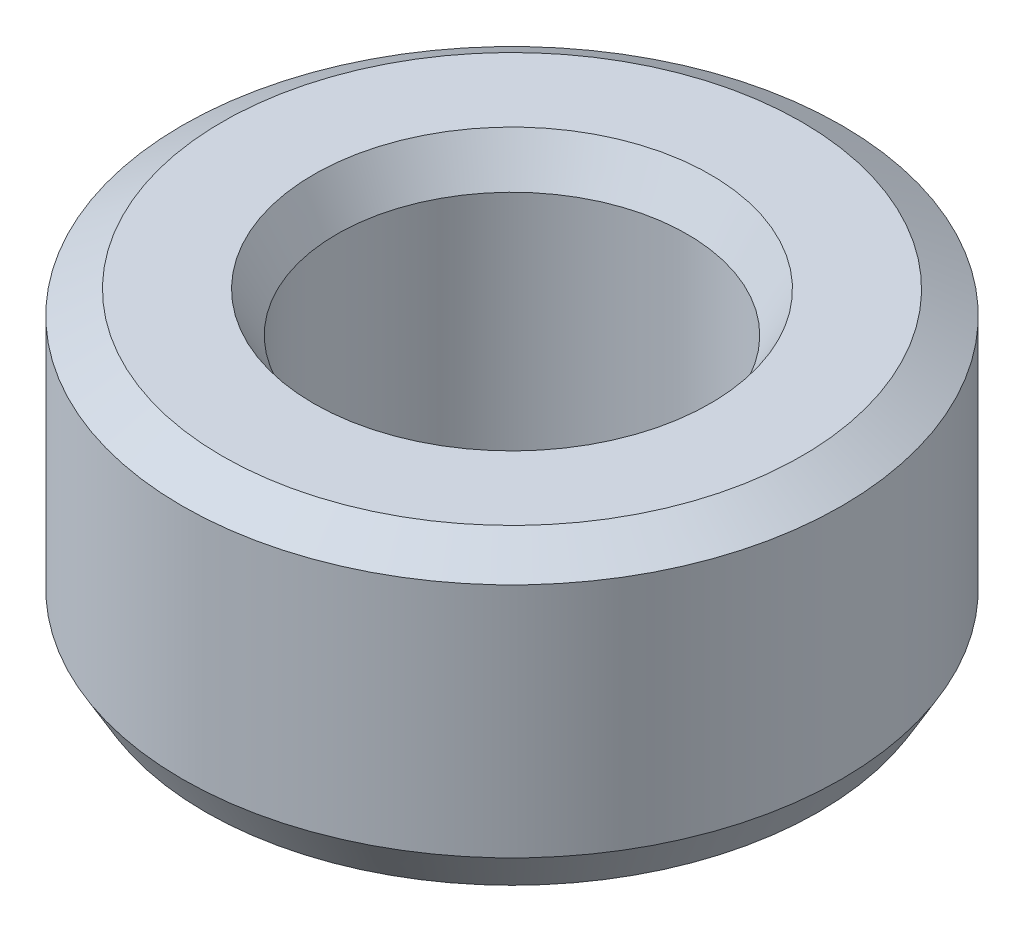
ISO-10303-21;
HEADER;
FILE_DESCRIPTION(('STEP AP214'),'2;1');
FILE_NAME('part.step','',(''),(''),'','','');
FILE_SCHEMA(('AUTOMOTIVE_DESIGN { 1 0 10303 214 1 1 1 1 }'));
ENDSEC;
DATA;
#1=APPLICATION_CONTEXT('core data for automotive mechanical design processes');
#2=APPLICATION_PROTOCOL_DEFINITION('international standard','automotive_design',2000,#1);
#3=PRODUCT_CONTEXT('',#1,'mechanical');
#4=PRODUCT('Part','Part','',(#3));
#5=PRODUCT_RELATED_PRODUCT_CATEGORY('part','',(#4));
#6=PRODUCT_DEFINITION_FORMATION('','',#4);
#7=PRODUCT_DEFINITION_CONTEXT('part definition',#1,'design');
#8=PRODUCT_DEFINITION('design','',#6,#7);
#9=PRODUCT_DEFINITION_SHAPE('','',#8);
#10=(LENGTH_UNIT() NAMED_UNIT(*) SI_UNIT(.MILLI.,.METRE.));
#11=(NAMED_UNIT(*) PLANE_ANGLE_UNIT() SI_UNIT($,.RADIAN.));
#12=(NAMED_UNIT(*) SI_UNIT($,.STERADIAN.) SOLID_ANGLE_UNIT());
#13=UNCERTAINTY_MEASURE_WITH_UNIT(LENGTH_MEASURE(1.E-05),#10,'distance_accuracy_value','');
#14=(GEOMETRIC_REPRESENTATION_CONTEXT(3) GLOBAL_UNCERTAINTY_ASSIGNED_CONTEXT((#13)) GLOBAL_UNIT_ASSIGNED_CONTEXT((#10,
#11,#12)) REPRESENTATION_CONTEXT('',''));
#15=CARTESIAN_POINT('',(0.,0.,0.));
#16=DIRECTION('',(0.,0.,1.));
#17=DIRECTION('',(1.,0.,0.));
#18=AXIS2_PLACEMENT_3D('',#15,#16,#17);
#19=CARTESIAN_POINT('',(0.,11.3614162811045,0.));
#20=DIRECTION('',(0.,-1.,0.));
#21=DIRECTION('',(0.,0.,-1.));
#22=AXIS2_PLACEMENT_3D('',#19,#20,#21);
#23=CYLINDRICAL_SURFACE('',#22,12.5);
#24=CARTESIAN_POINT('',(0.,1.51972632499675,0.));
#25=DIRECTION('',(0.,1.,0.));
#26=DIRECTION('',(0.,0.,1.));
#27=AXIS2_PLACEMENT_3D('',#24,#25,#26);
#28=CIRCLE('',#27,12.5);
#29=CARTESIAN_POINT('',(0.,1.51972632499675,12.5));
#30=VERTEX_POINT('',#29);
#31=EDGE_CURVE('E10',#30,#30,#28,.T.);
#32=ORIENTED_EDGE('',*,*,#31,.T.);
#33=EDGE_LOOP('',(#32));
#34=FACE_BOUND('',#33,.T.);
#35=CARTESIAN_POINT('',(0.,10.484001878273,0.));
#36=DIRECTION('',(0.,1.,0.));
#37=DIRECTION('',(0.,0.,1.));
#38=AXIS2_PLACEMENT_3D('',#35,#36,#37);
#39=CIRCLE('',#38,12.5);
#40=CARTESIAN_POINT('',(0.,10.484001878273,12.5));
#41=VERTEX_POINT('',#40);
#42=EDGE_CURVE('E50',#41,#41,#39,.F.);
#43=ORIENTED_EDGE('',*,*,#42,.T.);
#44=EDGE_LOOP('',(#43));
#45=FACE_BOUND('',#44,.T.);
#46=ADVANCED_FACE('F39',(#34,#45),#23,.T.);
#47=CARTESIAN_POINT('',(0.,11.3614162811045,0.));
#48=DIRECTION('',(0.,1.,0.));
#49=DIRECTION('',(0.,0.,1.));
#50=AXIS2_PLACEMENT_3D('',#47,#48,#49);
#51=PLANE('',#50);
#52=CARTESIAN_POINT('',(0.,11.3614162811045,0.));
#53=DIRECTION('',(0.,1.,0.));
#54=DIRECTION('',(0.,0.,1.));
#55=AXIS2_PLACEMENT_3D('',#52,#53,#54);
#56=CIRCLE('',#55,7.51986047261818);
#57=CARTESIAN_POINT('',(0.,11.3614162811045,7.51986047261818));
#58=VERTEX_POINT('',#57);
#59=EDGE_CURVE('E58',#58,#58,#56,.F.);
#60=ORIENTED_EDGE('',*,*,#59,.T.);
#61=EDGE_LOOP('',(#60));
#62=FACE_BOUND('',#61,.T.);
#63=CARTESIAN_POINT('',(0.,11.3614162811045,0.));
#64=DIRECTION('',(0.,1.,0.));
#65=DIRECTION('',(0.,0.,1.));
#66=AXIS2_PLACEMENT_3D('',#63,#64,#65);
#67=CIRCLE('',#66,10.9802736750032);
#68=CARTESIAN_POINT('',(0.,11.3614162811045,10.9802736750032));
#69=VERTEX_POINT('',#68);
#70=EDGE_CURVE('E61',#69,#69,#67,.T.);
#71=ORIENTED_EDGE('',*,*,#70,.T.);
#72=EDGE_LOOP('',(#71));
#73=FACE_BOUND('',#72,.T.);
#74=ADVANCED_FACE('F88',(#62,#73),#51,.T.);
#75=CARTESIAN_POINT('',(0.,0.,0.));
#76=DIRECTION('',(0.,1.,0.));
#77=DIRECTION('',(0.,0.,1.));
#78=AXIS2_PLACEMENT_3D('',#75,#76,#77);
#79=PLANE('',#78);
#80=CARTESIAN_POINT('',(0.,0.,0.));
#81=DIRECTION('',(0.,1.,0.));
#82=DIRECTION('',(0.,0.,1.));
#83=AXIS2_PLACEMENT_3D('',#80,#81,#82);
#84=CIRCLE('',#83,8.16217239478349);
#85=CARTESIAN_POINT('',(0.,0.,8.16217239478349));
#86=VERTEX_POINT('',#85);
#87=EDGE_CURVE('E51',#86,#86,#84,.T.);
#88=ORIENTED_EDGE('',*,*,#87,.T.);
#89=EDGE_LOOP('',(#88));
#90=FACE_BOUND('',#89,.T.);
#91=CARTESIAN_POINT('',(0.,0.,0.));
#92=DIRECTION('',(0.,1.,0.));
#93=DIRECTION('',(0.,0.,1.));
#94=AXIS2_PLACEMENT_3D('',#91,#92,#93);
#95=CIRCLE('',#94,11.6225855971686);
#96=CARTESIAN_POINT('',(0.,0.,11.6225855971686));
#97=VERTEX_POINT('',#96);
#98=EDGE_CURVE('E54',#97,#97,#95,.F.);
#99=ORIENTED_EDGE('',*,*,#98,.T.);
#100=EDGE_LOOP('',(#99));
#101=FACE_BOUND('',#100,.T.);
#102=ADVANCED_FACE('F83',(#90,#101),#79,.F.);
#103=CARTESIAN_POINT('',(0.,11.3614162811045,0.));
#104=DIRECTION('',(0.,-1.,0.));
#105=DIRECTION('',(0.,0.,-1.));
#106=AXIS2_PLACEMENT_3D('',#103,#104,#105);
#107=CYLINDRICAL_SURFACE('',#106,6.64244606978673);
#108=CARTESIAN_POINT('',(0.,9.84168995610772,0.));
#109=DIRECTION('',(0.,1.,0.));
#110=DIRECTION('',(0.,0.,1.));
#111=AXIS2_PLACEMENT_3D('',#108,#109,#110);
#112=CIRCLE('',#111,6.64244606978673);
#113=CARTESIAN_POINT('',(0.,9.84168995610772,6.64244606978673));
#114=VERTEX_POINT('',#113);
#115=EDGE_CURVE('E67',#114,#114,#112,.T.);
#116=ORIENTED_EDGE('',*,*,#115,.T.);
#117=EDGE_LOOP('',(#116));
#118=FACE_BOUND('',#117,.T.);
#119=CARTESIAN_POINT('',(0.,0.87741440283145,0.));
#120=DIRECTION('',(0.,1.,0.));
#121=DIRECTION('',(0.,0.,1.));
#122=AXIS2_PLACEMENT_3D('',#119,#120,#121);
#123=CIRCLE('',#122,6.64244606978673);
#124=CARTESIAN_POINT('',(0.,0.87741440283145,6.64244606978673));
#125=VERTEX_POINT('',#124);
#126=EDGE_CURVE('E69',#125,#125,#123,.F.);
#127=ORIENTED_EDGE('',*,*,#126,.T.);
#128=EDGE_LOOP('',(#127));
#129=FACE_BOUND('',#128,.T.);
#130=ADVANCED_FACE('F71',(#118,#129),#107,.F.);
#131=CARTESIAN_POINT('',(0.,9.84168995610772,0.));
#132=DIRECTION('',(0.,1.,0.));
#133=DIRECTION('',(0.,0.,1.));
#134=AXIS2_PLACEMENT_3D('',#131,#132,#133);
#135=CONICAL_SURFACE('',#134,6.64244606978673,0.523598775598303);
#136=ORIENTED_EDGE('',*,*,#59,.F.);
#137=EDGE_LOOP('',(#136));
#138=FACE_BOUND('',#137,.T.);
#139=ORIENTED_EDGE('',*,*,#115,.F.);
#140=EDGE_LOOP('',(#139));
#141=FACE_BOUND('',#140,.T.);
#142=ADVANCED_FACE('F77',(#138,#141),#135,.F.);
#143=CARTESIAN_POINT('',(0.,0.,0.));
#144=DIRECTION('',(0.,-1.,0.));
#145=DIRECTION('',(0.,0.,-1.));
#146=AXIS2_PLACEMENT_3D('',#143,#144,#145);
#147=CONICAL_SURFACE('',#146,8.16217239478349,1.04719755119659);
#148=ORIENTED_EDGE('',*,*,#126,.F.);
#149=EDGE_LOOP('',(#148));
#150=FACE_BOUND('',#149,.T.);
#151=ORIENTED_EDGE('',*,*,#87,.F.);
#152=EDGE_LOOP('',(#151));
#153=FACE_BOUND('',#152,.T.);
#154=ADVANCED_FACE('F73',(#150,#153),#147,.F.);
#155=CARTESIAN_POINT('',(0.,1.51972632499675,0.));
#156=DIRECTION('',(0.,1.,0.));
#157=DIRECTION('',(0.,0.,1.));
#158=AXIS2_PLACEMENT_3D('',#155,#156,#157);
#159=CONICAL_SURFACE('',#158,12.5,0.523598775598303);
#160=CARTESIAN_POINT('',(0.,0.,11.6225855971686));
#161=CARTESIAN_POINT('',(0.,0.0158304825520489,11.6317253305314));
#162=CARTESIAN_POINT('',(0.,0.0316609651040985,11.6408650638942));
#163=CARTESIAN_POINT('',(0.,0.0633219302081977,11.6591445306199));
#164=CARTESIAN_POINT('',(0.,0.0791524127602473,11.6682842639827));
#165=CARTESIAN_POINT('',(0.,0.110813377864346,11.6865637307083));
#166=CARTESIAN_POINT('',(0.,0.126643860416396,11.6957034640712));
#167=CARTESIAN_POINT('',(0.,0.158304825520495,11.7139829307968));
#168=CARTESIAN_POINT('',(0.,0.174135308072544,11.7231226641597));
#169=CARTESIAN_POINT('',(0.,0.205796273176643,11.7414021308853));
#170=CARTESIAN_POINT('',(0.,0.221626755728693,11.7505418642481));
#171=CARTESIAN_POINT('',(0.,0.253287720832791,11.7688213309738));
#172=CARTESIAN_POINT('',(0.,0.269118203384841,11.7779610643366));
#173=CARTESIAN_POINT('',(0.,0.30077916848894,11.7962405310623));
#174=CARTESIAN_POINT('',(0.,0.31660965104099,11.8053802644251));
#175=CARTESIAN_POINT('',(0.,0.348270616145089,11.8236597311508));
#176=CARTESIAN_POINT('',(0.,0.364101098697138,11.8327994645136));
#177=CARTESIAN_POINT('',(0.,0.395762063801237,11.8510789312392));
#178=CARTESIAN_POINT('',(0.,0.411592546353286,11.8602186646021));
#179=CARTESIAN_POINT('',(0.,0.443253511457385,11.8784981313277));
#180=CARTESIAN_POINT('',(0.,0.459083994009435,11.8876378646906));
#181=CARTESIAN_POINT('',(0.,0.490744959113534,11.9059173314162));
#182=CARTESIAN_POINT('',(0.,0.506575441665583,11.915057064779));
#183=CARTESIAN_POINT('',(0.,0.538236406769683,11.9333365315047));
#184=CARTESIAN_POINT('',(0.,0.554066889321732,11.9424762648675));
#185=CARTESIAN_POINT('',(0.,0.585727854425831,11.9607557315932));
#186=CARTESIAN_POINT('',(0.,0.60155833697788,11.969895464956));
#187=CARTESIAN_POINT('',(0.,0.633219302081979,11.9881749316817));
#188=CARTESIAN_POINT('',(0.,0.649049784634029,11.9973146650445));
#189=CARTESIAN_POINT('',(0.,0.680710749738128,12.0155941317701));
#190=CARTESIAN_POINT('',(0.,0.696541232290177,12.024733865133));
#191=CARTESIAN_POINT('',(0.,0.728202197394276,12.0430133318586));
#192=CARTESIAN_POINT('',(0.,0.744032679946326,12.0521530652215));
#193=CARTESIAN_POINT('',(0.,0.775693645050425,12.0704325319471));
#194=CARTESIAN_POINT('',(0.,0.791524127602474,12.0795722653099));
#195=CARTESIAN_POINT('',(0.,0.823185092706573,12.0978517320356));
#196=CARTESIAN_POINT('',(0.,0.839015575258623,12.1069914653984));
#197=CARTESIAN_POINT('',(0.,0.870676540362722,12.1252709321241));
#198=CARTESIAN_POINT('',(0.,0.886507022914771,12.1344106654869));
#199=CARTESIAN_POINT('',(0.,0.91816798801887,12.1526901322126));
#200=CARTESIAN_POINT('',(0.,0.933998470570919,12.1618298655754));
#201=CARTESIAN_POINT('',(0.,0.965659435675019,12.180109332301));
#202=CARTESIAN_POINT('',(0.,0.981489918227068,12.1892490656639));
#203=CARTESIAN_POINT('',(0.,1.01315088333117,12.2075285323895));
#204=CARTESIAN_POINT('',(0.,1.02898136588322,12.2166682657523));
#205=CARTESIAN_POINT('',(0.,1.06064233098732,12.234947732478));
#206=CARTESIAN_POINT('',(0.,1.07647281353937,12.2440874658408));
#207=CARTESIAN_POINT('',(0.,1.10813377864346,12.2623669325665));
#208=CARTESIAN_POINT('',(0.,1.12396426119551,12.2715066659293));
#209=CARTESIAN_POINT('',(0.,1.15562522629961,12.289786132655));
#210=CARTESIAN_POINT('',(0.,1.17145570885166,12.2989258660178));
#211=CARTESIAN_POINT('',(0.,1.20311667395576,12.3172053327435));
#212=CARTESIAN_POINT('',(0.,1.21894715650781,12.3263450661063));
#213=CARTESIAN_POINT('',(0.,1.25060812161191,12.3446245328319));
#214=CARTESIAN_POINT('',(0.,1.26643860416396,12.3537642661948));
#215=CARTESIAN_POINT('',(0.,1.29809956926806,12.3720437329204));
#216=CARTESIAN_POINT('',(0.,1.31393005182011,12.3811834662832));
#217=CARTESIAN_POINT('',(0.,1.34559101692421,12.3994629330089));
#218=CARTESIAN_POINT('',(0.,1.36142149947626,12.4086026663717));
#219=CARTESIAN_POINT('',(0.,1.39308246458035,12.4268821330974));
#220=CARTESIAN_POINT('',(0.,1.4089129471324,12.4360218664602));
#221=CARTESIAN_POINT('',(0.,1.4405739122365,12.4543013331859));
#222=CARTESIAN_POINT('',(0.,1.45640439478855,12.4634410665487));
#223=CARTESIAN_POINT('',(0.,1.48806535989265,12.4817205332743));
#224=CARTESIAN_POINT('',(0.,1.5038958424447,12.4908602666372));
#225=CARTESIAN_POINT('',(0.,1.51972632499675,12.5));
#226=B_SPLINE_CURVE_WITH_KNOTS('',3,(#160,#161,#162,#163,#164,#165,#166,#167,#168,#169,#170,
#171,#172,#173,#174,#175,#176,#177,#178,#179,#180,#181,#182,#183,#184,#185,#186,#187,#188,#189,
#190,#191,#192,#193,#194,#195,#196,#197,#198,#199,#200,#201,#202,#203,#204,#205,#206,#207,#208,
#209,#210,#211,#212,#213,#214,#215,#216,#217,#218,#219,#220,#221,#222,#223,#224,#225),
.UNSPECIFIED.,.F.,.F.,(4,2,2,2,2,2,2,2,2,2,2,2,2,2,2,2,2,2,2,2,2,2,2,2,2,2,2,2,2,2,2,2,4),(0.,
0.054838400176965,0.109676800353929,0.164515200530894,0.219353600707859,0.274192000884824,
0.329030401061789,0.383868801238753,0.438707201415718,0.493545601592683,0.548384001769648,
0.603222401946612,0.658060802123577,0.712899202300542,0.767737602477507,0.822576002654472,
0.877414402831437,0.932252803008402,0.987091203185367,1.04192960336233,1.0967680035393,
1.15160640371626,1.20644480389323,1.26128320407019,1.31612160424716,1.37096000442412,
1.42579840460108,1.48063680477805,1.53547520495501,1.59031360513198,1.64515200530894,
1.69999040548591,1.75482880566287),.UNSPECIFIED.);
#227=EDGE_CURVE('BSEAM76',#97,#30,#226,.T.);
#228=ORIENTED_EDGE('',*,*,#98,.F.);
#229=ORIENTED_EDGE('',*,*,#31,.F.);
#230=ORIENTED_EDGE('',*,*,#227,.T.);
#231=ORIENTED_EDGE('',*,*,#227,.F.);
#232=EDGE_LOOP('',(#228,#230,#229,#231));
#233=FACE_BOUND('',#232,.T.);
#234=ADVANCED_FACE('F76',(#233),#159,.T.);
#235=CARTESIAN_POINT('',(0.,11.3614162811045,0.));
#236=DIRECTION('',(0.,-1.,0.));
#237=DIRECTION('',(0.,0.,-1.));
#238=AXIS2_PLACEMENT_3D('',#235,#236,#237);
#239=CONICAL_SURFACE('',#238,10.9802736750032,1.04719755119659);
#240=ORIENTED_EDGE('',*,*,#42,.F.);
#241=EDGE_LOOP('',(#240));
#242=FACE_BOUND('',#241,.T.);
#243=ORIENTED_EDGE('',*,*,#70,.F.);
#244=EDGE_LOOP('',(#243));
#245=FACE_BOUND('',#244,.T.);
#246=ADVANCED_FACE('F45',(#242,#245),#239,.T.);
#247=CLOSED_SHELL('',(#46,#74,#102,#130,#142,#154,#234,#246));
#248=MANIFOLD_SOLID_BREP('B2',#247);
#249=ADVANCED_BREP_SHAPE_REPRESENTATION('',(#18,#248),#14);
#250=SHAPE_DEFINITION_REPRESENTATION(#9,#249);
ENDSEC;
END-ISO-10303-21;
